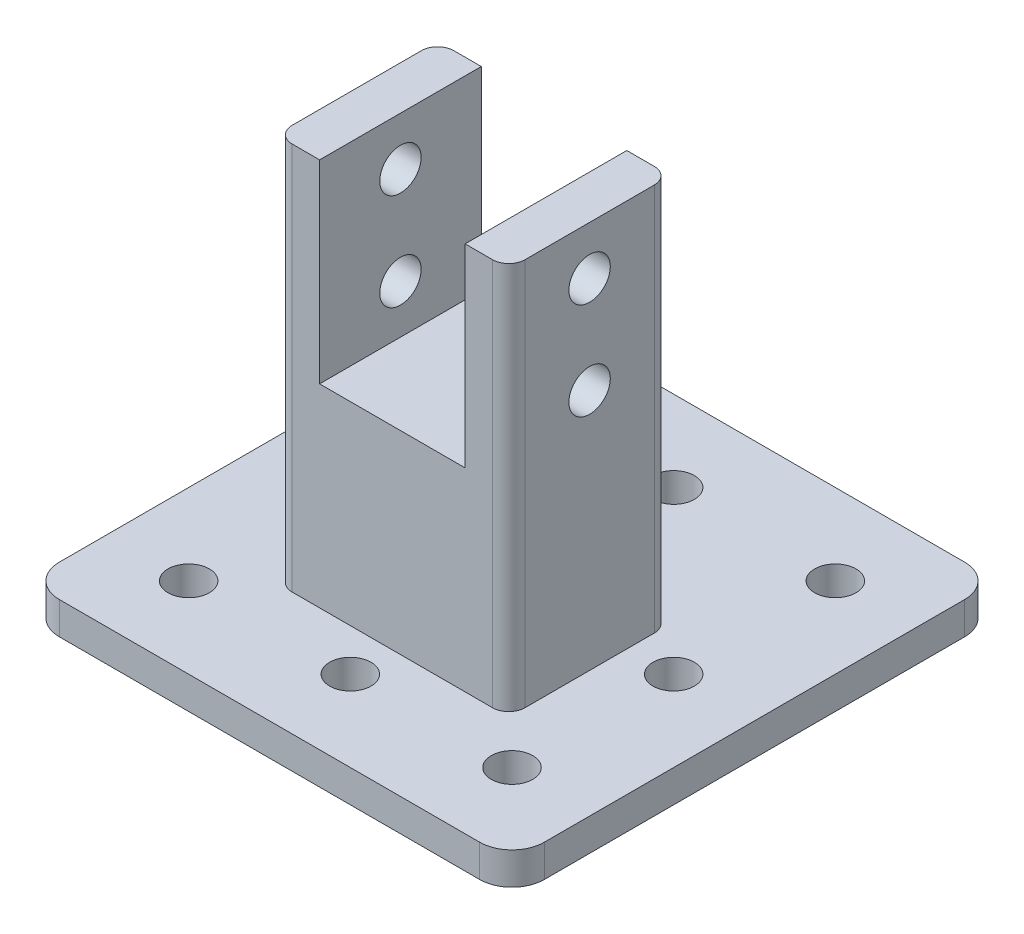
ISO-10303-21;
HEADER;
FILE_DESCRIPTION(('STEP AP214'),'2;1');
FILE_NAME('part.step','',(''),(''),'','','');
FILE_SCHEMA(('AUTOMOTIVE_DESIGN { 1 0 10303 214 1 1 1 1 }'));
ENDSEC;
DATA;
#1=APPLICATION_CONTEXT('core data for automotive mechanical design processes');
#2=APPLICATION_PROTOCOL_DEFINITION('international standard','automotive_design',2000,#1);
#3=PRODUCT_CONTEXT('',#1,'mechanical');
#4=PRODUCT('Part','Part','',(#3));
#5=PRODUCT_RELATED_PRODUCT_CATEGORY('part','',(#4));
#6=PRODUCT_DEFINITION_FORMATION('','',#4);
#7=PRODUCT_DEFINITION_CONTEXT('part definition',#1,'design');
#8=PRODUCT_DEFINITION('design','',#6,#7);
#9=PRODUCT_DEFINITION_SHAPE('','',#8);
#10=(LENGTH_UNIT() NAMED_UNIT(*) SI_UNIT(.MILLI.,.METRE.));
#11=(NAMED_UNIT(*) PLANE_ANGLE_UNIT() SI_UNIT($,.RADIAN.));
#12=(NAMED_UNIT(*) SI_UNIT($,.STERADIAN.) SOLID_ANGLE_UNIT());
#13=UNCERTAINTY_MEASURE_WITH_UNIT(LENGTH_MEASURE(1.E-05),#10,'distance_accuracy_value','');
#14=(GEOMETRIC_REPRESENTATION_CONTEXT(3) GLOBAL_UNCERTAINTY_ASSIGNED_CONTEXT((#13)) GLOBAL_UNIT_ASSIGNED_CONTEXT((#10,
#11,#12)) REPRESENTATION_CONTEXT('',''));
#15=CARTESIAN_POINT('',(0.,0.,0.));
#16=DIRECTION('',(0.,0.,1.));
#17=DIRECTION('',(1.,0.,0.));
#18=AXIS2_PLACEMENT_3D('',#15,#16,#17);
#19=CARTESIAN_POINT('',(0.,35.,0.));
#20=DIRECTION('',(0.,-1.,0.));
#21=DIRECTION('',(0.,0.,-1.));
#22=AXIS2_PLACEMENT_3D('',#19,#20,#21);
#23=PLANE('',#22);
#24=DIRECTION('',(0.,0.,-1.));
#25=VECTOR('',#24,1.);
#26=CARTESIAN_POINT('',(11.25,35.,-6.5));
#27=LINE('',#26,#25);
#28=CARTESIAN_POINT('',(11.25,35.,18.5));
#29=VERTEX_POINT('',#28);
#30=CARTESIAN_POINT('',(11.25,35.,-6.5));
#31=VERTEX_POINT('',#30);
#32=EDGE_CURVE('E50',#29,#31,#27,.T.);
#33=ORIENTED_EDGE('',*,*,#32,.T.);
#34=DIRECTION('',(1.,0.,0.));
#35=VECTOR('',#34,1.);
#36=CARTESIAN_POINT('',(18.,35.,-6.5));
#37=LINE('',#36,#35);
#38=CARTESIAN_POINT('',(-11.25,35.,-6.5));
#39=VERTEX_POINT('',#38);
#40=EDGE_CURVE('E245',#39,#31,#37,.T.);
#41=ORIENTED_EDGE('',*,*,#40,.F.);
#42=DIRECTION('',(0.,0.,1.));
#43=VECTOR('',#42,1.);
#44=CARTESIAN_POINT('',(-11.25,35.,-6.5));
#45=LINE('',#44,#43);
#46=CARTESIAN_POINT('',(-11.25,35.,18.5));
#47=VERTEX_POINT('',#46);
#48=EDGE_CURVE('E214',#39,#47,#45,.T.);
#49=ORIENTED_EDGE('',*,*,#48,.T.);
#50=DIRECTION('',(-1.,0.,0.));
#51=VECTOR('',#50,1.);
#52=CARTESIAN_POINT('',(18.,35.,18.5));
#53=LINE('',#52,#51);
#54=EDGE_CURVE('E55',#29,#47,#53,.T.);
#55=ORIENTED_EDGE('',*,*,#54,.F.);
#56=EDGE_LOOP('',(#33,#41,#49,#55));
#57=FACE_BOUND('',#56,.T.);
#58=ADVANCED_FACE('F33',(#57),#23,.F.);
#59=CARTESIAN_POINT('',(-32.5,5.,32.5));
#60=DIRECTION('',(0.,1.,0.));
#61=DIRECTION('',(0.,0.,1.));
#62=AXIS2_PLACEMENT_3D('',#59,#60,#61);
#63=PLANE('',#62);
#64=CARTESIAN_POINT('',(-25.,5.,-25.));
#65=DIRECTION('',(0.,1.,0.));
#66=DIRECTION('',(0.,0.,1.));
#67=AXIS2_PLACEMENT_3D('',#64,#65,#66);
#68=CIRCLE('',#67,3.2);
#69=CARTESIAN_POINT('',(-25.,5.,-21.8));
#70=VERTEX_POINT('',#69);
#71=EDGE_CURVE('E249',#70,#70,#68,.T.);
#72=ORIENTED_EDGE('',*,*,#71,.F.);
#73=EDGE_LOOP('',(#72));
#74=FACE_BOUND('',#73,.T.);
#75=CARTESIAN_POINT('',(-25.,5.,0.));
#76=DIRECTION('',(0.,1.,0.));
#77=DIRECTION('',(0.,0.,1.));
#78=AXIS2_PLACEMENT_3D('',#75,#76,#77);
#79=CIRCLE('',#78,3.2);
#80=CARTESIAN_POINT('',(-25.,5.,3.2));
#81=VERTEX_POINT('',#80);
#82=EDGE_CURVE('E257',#81,#81,#79,.T.);
#83=ORIENTED_EDGE('',*,*,#82,.F.);
#84=EDGE_LOOP('',(#83));
#85=FACE_BOUND('',#84,.T.);
#86=CARTESIAN_POINT('',(-25.,5.,25.));
#87=DIRECTION('',(0.,1.,0.));
#88=DIRECTION('',(0.,0.,1.));
#89=AXIS2_PLACEMENT_3D('',#86,#87,#88);
#90=CIRCLE('',#89,3.2);
#91=CARTESIAN_POINT('',(-25.,5.,28.2));
#92=VERTEX_POINT('',#91);
#93=EDGE_CURVE('E263',#92,#92,#90,.T.);
#94=ORIENTED_EDGE('',*,*,#93,.F.);
#95=EDGE_LOOP('',(#94));
#96=FACE_BOUND('',#95,.T.);
#97=CARTESIAN_POINT('',(0.,5.,25.));
#98=DIRECTION('',(0.,1.,0.));
#99=DIRECTION('',(0.,0.,1.));
#100=AXIS2_PLACEMENT_3D('',#97,#98,#99);
#101=CIRCLE('',#100,3.2);
#102=CARTESIAN_POINT('',(0.,5.,28.2));
#103=VERTEX_POINT('',#102);
#104=EDGE_CURVE('E269',#103,#103,#101,.T.);
#105=ORIENTED_EDGE('',*,*,#104,.F.);
#106=EDGE_LOOP('',(#105));
#107=FACE_BOUND('',#106,.T.);
#108=CARTESIAN_POINT('',(25.,5.,25.));
#109=DIRECTION('',(0.,1.,0.));
#110=DIRECTION('',(0.,0.,1.));
#111=AXIS2_PLACEMENT_3D('',#108,#109,#110);
#112=CIRCLE('',#111,3.2);
#113=CARTESIAN_POINT('',(25.,5.,28.2));
#114=VERTEX_POINT('',#113);
#115=EDGE_CURVE('E275',#114,#114,#112,.T.);
#116=ORIENTED_EDGE('',*,*,#115,.F.);
#117=EDGE_LOOP('',(#116));
#118=FACE_BOUND('',#117,.T.);
#119=CARTESIAN_POINT('',(25.,5.,0.));
#120=DIRECTION('',(0.,1.,0.));
#121=DIRECTION('',(0.,0.,1.));
#122=AXIS2_PLACEMENT_3D('',#119,#120,#121);
#123=CIRCLE('',#122,3.2);
#124=CARTESIAN_POINT('',(25.,5.,3.2));
#125=VERTEX_POINT('',#124);
#126=EDGE_CURVE('E281',#125,#125,#123,.T.);
#127=ORIENTED_EDGE('',*,*,#126,.F.);
#128=EDGE_LOOP('',(#127));
#129=FACE_BOUND('',#128,.T.);
#130=CARTESIAN_POINT('',(25.,5.,-25.));
#131=DIRECTION('',(0.,1.,0.));
#132=DIRECTION('',(0.,0.,1.));
#133=AXIS2_PLACEMENT_3D('',#130,#131,#132);
#134=CIRCLE('',#133,3.2);
#135=CARTESIAN_POINT('',(25.,5.,-21.8));
#136=VERTEX_POINT('',#135);
#137=EDGE_CURVE('E243',#136,#136,#134,.T.);
#138=ORIENTED_EDGE('',*,*,#137,.F.);
#139=EDGE_LOOP('',(#138));
#140=FACE_BOUND('',#139,.T.);
#141=CARTESIAN_POINT('',(0.,5.,-25.));
#142=DIRECTION('',(0.,1.,0.));
#143=DIRECTION('',(0.,0.,1.));
#144=AXIS2_PLACEMENT_3D('',#141,#142,#143);
#145=CIRCLE('',#144,3.2);
#146=CARTESIAN_POINT('',(0.,5.,-21.8));
#147=VERTEX_POINT('',#146);
#148=EDGE_CURVE('E256',#147,#147,#145,.T.);
#149=ORIENTED_EDGE('',*,*,#148,.F.);
#150=EDGE_LOOP('',(#149));
#151=FACE_BOUND('',#150,.T.);
#152=CARTESIAN_POINT('',(-32.5,5.,32.5));
#153=DIRECTION('',(0.,1.,0.));
#154=DIRECTION('',(0.,0.,1.));
#155=AXIS2_PLACEMENT_3D('',#152,#153,#154);
#156=CIRCLE('',#155,4.99999999999999);
#157=CARTESIAN_POINT('',(-37.5,5.,32.5));
#158=VERTEX_POINT('',#157);
#159=CARTESIAN_POINT('',(-32.5,5.,37.5));
#160=VERTEX_POINT('',#159);
#161=EDGE_CURVE('E297',#158,#160,#156,.T.);
#162=ORIENTED_EDGE('',*,*,#161,.T.);
#163=DIRECTION('',(1.,0.,0.));
#164=VECTOR('',#163,1.);
#165=CARTESIAN_POINT('',(-32.5,5.,37.5));
#166=LINE('',#165,#164);
#167=CARTESIAN_POINT('',(32.5,5.,37.5));
#168=VERTEX_POINT('',#167);
#169=EDGE_CURVE('E300',#160,#168,#166,.T.);
#170=ORIENTED_EDGE('',*,*,#169,.T.);
#171=CARTESIAN_POINT('',(32.5,5.,32.5));
#172=DIRECTION('',(0.,1.,0.));
#173=DIRECTION('',(0.,0.,1.));
#174=AXIS2_PLACEMENT_3D('',#171,#172,#173);
#175=CIRCLE('',#174,4.99999999999999);
#176=CARTESIAN_POINT('',(37.5,5.,32.5));
#177=VERTEX_POINT('',#176);
#178=EDGE_CURVE('E303',#168,#177,#175,.T.);
#179=ORIENTED_EDGE('',*,*,#178,.T.);
#180=DIRECTION('',(0.,0.,-1.));
#181=VECTOR('',#180,1.);
#182=CARTESIAN_POINT('',(37.5,5.,-32.5));
#183=LINE('',#182,#181);
#184=CARTESIAN_POINT('',(37.5,5.,-32.5));
#185=VERTEX_POINT('',#184);
#186=EDGE_CURVE('E305',#177,#185,#183,.T.);
#187=ORIENTED_EDGE('',*,*,#186,.T.);
#188=CARTESIAN_POINT('',(32.5,5.,-32.5));
#189=DIRECTION('',(0.,1.,0.));
#190=DIRECTION('',(0.,0.,-1.));
#191=AXIS2_PLACEMENT_3D('',#188,#189,#190);
#192=CIRCLE('',#191,4.99999999999999);
#193=CARTESIAN_POINT('',(32.5,5.,-37.5));
#194=VERTEX_POINT('',#193);
#195=EDGE_CURVE('E307',#185,#194,#192,.T.);
#196=ORIENTED_EDGE('',*,*,#195,.T.);
#197=DIRECTION('',(-1.,0.,0.));
#198=VECTOR('',#197,1.);
#199=CARTESIAN_POINT('',(-32.5,5.,-37.5));
#200=LINE('',#199,#198);
#201=CARTESIAN_POINT('',(-32.5,5.,-37.5));
#202=VERTEX_POINT('',#201);
#203=EDGE_CURVE('E309',#194,#202,#200,.T.);
#204=ORIENTED_EDGE('',*,*,#203,.T.);
#205=CARTESIAN_POINT('',(-32.5,5.,-32.5));
#206=DIRECTION('',(0.,1.,0.));
#207=DIRECTION('',(0.,0.,1.));
#208=AXIS2_PLACEMENT_3D('',#205,#206,#207);
#209=CIRCLE('',#208,4.99999999999999);
#210=CARTESIAN_POINT('',(-37.5,5.,-32.5));
#211=VERTEX_POINT('',#210);
#212=EDGE_CURVE('E311',#202,#211,#209,.T.);
#213=ORIENTED_EDGE('',*,*,#212,.T.);
#214=DIRECTION('',(0.,0.,1.));
#215=VECTOR('',#214,1.);
#216=CARTESIAN_POINT('',(-37.5,5.,-32.5));
#217=LINE('',#216,#215);
#218=EDGE_CURVE('E313',#211,#158,#217,.T.);
#219=ORIENTED_EDGE('',*,*,#218,.T.);
#220=EDGE_LOOP('',(#162,#170,#179,#187,#196,#204,#213,#219));
#221=FACE_BOUND('',#220,.T.);
#222=DIRECTION('',(0.,0.,1.));
#223=VECTOR('',#222,1.);
#224=CARTESIAN_POINT('',(-18.,5.,-6.5));
#225=LINE('',#224,#223);
#226=CARTESIAN_POINT('',(-18.,5.,-4.));
#227=VERTEX_POINT('',#226);
#228=CARTESIAN_POINT('',(-18.,5.,16.));
#229=VERTEX_POINT('',#228);
#230=EDGE_CURVE('E234',#227,#229,#225,.T.);
#231=ORIENTED_EDGE('',*,*,#230,.F.);
#232=CARTESIAN_POINT('',(-15.5,5.,-4.));
#233=DIRECTION('',(0.,1.,0.));
#234=DIRECTION('',(0.,0.,1.));
#235=AXIS2_PLACEMENT_3D('',#232,#233,#234);
#236=CIRCLE('',#235,2.5);
#237=CARTESIAN_POINT('',(-15.5,5.,-6.5));
#238=VERTEX_POINT('',#237);
#239=EDGE_CURVE('E368',#227,#238,#236,.F.);
#240=ORIENTED_EDGE('',*,*,#239,.T.);
#241=DIRECTION('',(-1.,0.,0.));
#242=VECTOR('',#241,1.);
#243=CARTESIAN_POINT('',(18.,5.,-6.5));
#244=LINE('',#243,#242);
#245=CARTESIAN_POINT('',(15.5,5.,-6.5));
#246=VERTEX_POINT('',#245);
#247=EDGE_CURVE('E238',#246,#238,#244,.T.);
#248=ORIENTED_EDGE('',*,*,#247,.F.);
#249=CARTESIAN_POINT('',(15.5,5.,-4.));
#250=DIRECTION('',(0.,1.,0.));
#251=DIRECTION('',(0.,0.,1.));
#252=AXIS2_PLACEMENT_3D('',#249,#250,#251);
#253=CIRCLE('',#252,2.5);
#254=CARTESIAN_POINT('',(18.,5.,-4.));
#255=VERTEX_POINT('',#254);
#256=EDGE_CURVE('E42',#246,#255,#253,.F.);
#257=ORIENTED_EDGE('',*,*,#256,.T.);
#258=DIRECTION('',(0.,0.,-1.));
#259=VECTOR('',#258,1.);
#260=CARTESIAN_POINT('',(18.,5.,-6.5));
#261=LINE('',#260,#259);
#262=CARTESIAN_POINT('',(18.,5.,16.));
#263=VERTEX_POINT('',#262);
#264=EDGE_CURVE('E241',#263,#255,#261,.T.);
#265=ORIENTED_EDGE('',*,*,#264,.F.);
#266=CARTESIAN_POINT('',(15.5,5.,16.));
#267=DIRECTION('',(0.,1.,0.));
#268=DIRECTION('',(0.,0.,1.));
#269=AXIS2_PLACEMENT_3D('',#266,#267,#268);
#270=CIRCLE('',#269,2.5);
#271=CARTESIAN_POINT('',(15.5,5.,18.5));
#272=VERTEX_POINT('',#271);
#273=EDGE_CURVE('E11',#263,#272,#270,.F.);
#274=ORIENTED_EDGE('',*,*,#273,.T.);
#275=DIRECTION('',(1.,0.,0.));
#276=VECTOR('',#275,1.);
#277=CARTESIAN_POINT('',(18.,5.,18.5));
#278=LINE('',#277,#276);
#279=CARTESIAN_POINT('',(-15.5,5.,18.5));
#280=VERTEX_POINT('',#279);
#281=EDGE_CURVE('E237',#280,#272,#278,.T.);
#282=ORIENTED_EDGE('',*,*,#281,.F.);
#283=CARTESIAN_POINT('',(-15.5,5.,16.));
#284=DIRECTION('',(0.,1.,0.));
#285=DIRECTION('',(0.,0.,1.));
#286=AXIS2_PLACEMENT_3D('',#283,#284,#285);
#287=CIRCLE('',#286,2.5);
#288=EDGE_CURVE('E366',#280,#229,#287,.F.);
#289=ORIENTED_EDGE('',*,*,#288,.T.);
#290=EDGE_LOOP('',(#231,#240,#248,#257,#265,#274,#282,#289));
#291=FACE_BOUND('',#290,.T.);
#292=ADVANCED_FACE('F408',(#74,#85,#96,#107,#118,#129,#140,#151,#221,#291),#63,.T.);
#293=CARTESIAN_POINT('',(-32.5,5.,32.5));
#294=DIRECTION('',(0.,-1.,0.));
#295=DIRECTION('',(0.,0.,-1.));
#296=AXIS2_PLACEMENT_3D('',#293,#294,#295);
#297=CYLINDRICAL_SURFACE('',#296,4.99999999999999);
#298=CARTESIAN_POINT('',(-32.5,0.,32.5));
#299=DIRECTION('',(0.,1.,0.));
#300=DIRECTION('',(0.,0.,1.));
#301=AXIS2_PLACEMENT_3D('',#298,#299,#300);
#302=CIRCLE('',#301,4.99999999999999);
#303=CARTESIAN_POINT('',(-37.5,0.,32.5));
#304=VERTEX_POINT('',#303);
#305=CARTESIAN_POINT('',(-32.5,0.,37.5));
#306=VERTEX_POINT('',#305);
#307=EDGE_CURVE('E296',#304,#306,#302,.T.);
#308=ORIENTED_EDGE('',*,*,#307,.T.);
#309=DIRECTION('',(0.,-1.,0.));
#310=VECTOR('',#309,1.);
#311=CARTESIAN_POINT('',(-32.5,5.,37.5));
#312=LINE('',#311,#310);
#313=EDGE_CURVE('E351',#160,#306,#312,.T.);
#314=ORIENTED_EDGE('',*,*,#313,.F.);
#315=ORIENTED_EDGE('',*,*,#161,.F.);
#316=DIRECTION('',(0.,-1.,0.));
#317=VECTOR('',#316,1.);
#318=CARTESIAN_POINT('',(-37.5,5.,32.5));
#319=LINE('',#318,#317);
#320=EDGE_CURVE('E315',#158,#304,#319,.T.);
#321=ORIENTED_EDGE('',*,*,#320,.T.);
#322=EDGE_LOOP('',(#308,#314,#315,#321));
#323=FACE_BOUND('',#322,.T.);
#324=ADVANCED_FACE('F438',(#323),#297,.T.);
#325=CARTESIAN_POINT('',(-32.5,5.,37.5));
#326=DIRECTION('',(0.,0.,-1.));
#327=DIRECTION('',(-1.,0.,0.));
#328=AXIS2_PLACEMENT_3D('',#325,#326,#327);
#329=PLANE('',#328);
#330=DIRECTION('',(1.,0.,0.));
#331=VECTOR('',#330,1.);
#332=CARTESIAN_POINT('',(-32.5,0.,37.5));
#333=LINE('',#332,#331);
#334=CARTESIAN_POINT('',(32.5,0.,37.5));
#335=VERTEX_POINT('',#334);
#336=EDGE_CURVE('E318',#306,#335,#333,.T.);
#337=ORIENTED_EDGE('',*,*,#336,.T.);
#338=DIRECTION('',(0.,-1.,0.));
#339=VECTOR('',#338,1.);
#340=CARTESIAN_POINT('',(32.5,5.,37.5));
#341=LINE('',#340,#339);
#342=EDGE_CURVE('E348',#168,#335,#341,.T.);
#343=ORIENTED_EDGE('',*,*,#342,.F.);
#344=ORIENTED_EDGE('',*,*,#169,.F.);
#345=ORIENTED_EDGE('',*,*,#313,.T.);
#346=EDGE_LOOP('',(#337,#343,#344,#345));
#347=FACE_BOUND('',#346,.T.);
#348=ADVANCED_FACE('F511',(#347),#329,.F.);
#349=CARTESIAN_POINT('',(32.5,5.,32.5));
#350=DIRECTION('',(0.,-1.,0.));
#351=DIRECTION('',(0.,0.,-1.));
#352=AXIS2_PLACEMENT_3D('',#349,#350,#351);
#353=CYLINDRICAL_SURFACE('',#352,4.99999999999999);
#354=CARTESIAN_POINT('',(32.5,0.,32.5));
#355=DIRECTION('',(0.,1.,0.));
#356=DIRECTION('',(0.,0.,1.));
#357=AXIS2_PLACEMENT_3D('',#354,#355,#356);
#358=CIRCLE('',#357,4.99999999999999);
#359=CARTESIAN_POINT('',(37.5,0.,32.5));
#360=VERTEX_POINT('',#359);
#361=EDGE_CURVE('E320',#335,#360,#358,.T.);
#362=ORIENTED_EDGE('',*,*,#361,.T.);
#363=DIRECTION('',(0.,-1.,0.));
#364=VECTOR('',#363,1.);
#365=CARTESIAN_POINT('',(37.5,5.,32.5));
#366=LINE('',#365,#364);
#367=EDGE_CURVE('E345',#177,#360,#366,.T.);
#368=ORIENTED_EDGE('',*,*,#367,.F.);
#369=ORIENTED_EDGE('',*,*,#178,.F.);
#370=ORIENTED_EDGE('',*,*,#342,.T.);
#371=EDGE_LOOP('',(#362,#368,#369,#370));
#372=FACE_BOUND('',#371,.T.);
#373=ADVANCED_FACE('F507',(#372),#353,.T.);
#374=CARTESIAN_POINT('',(37.5,5.,-32.5));
#375=DIRECTION('',(-1.,0.,0.));
#376=DIRECTION('',(0.,0.,1.));
#377=AXIS2_PLACEMENT_3D('',#374,#375,#376);
#378=PLANE('',#377);
#379=DIRECTION('',(0.,0.,-1.));
#380=VECTOR('',#379,1.);
#381=CARTESIAN_POINT('',(37.5,0.,-32.5));
#382=LINE('',#381,#380);
#383=CARTESIAN_POINT('',(37.5,0.,-32.5));
#384=VERTEX_POINT('',#383);
#385=EDGE_CURVE('E322',#360,#384,#382,.T.);
#386=ORIENTED_EDGE('',*,*,#385,.T.);
#387=DIRECTION('',(0.,-1.,0.));
#388=VECTOR('',#387,1.);
#389=CARTESIAN_POINT('',(37.5,5.,-32.5));
#390=LINE('',#389,#388);
#391=EDGE_CURVE('E342',#185,#384,#390,.T.);
#392=ORIENTED_EDGE('',*,*,#391,.F.);
#393=ORIENTED_EDGE('',*,*,#186,.F.);
#394=ORIENTED_EDGE('',*,*,#367,.T.);
#395=EDGE_LOOP('',(#386,#392,#393,#394));
#396=FACE_BOUND('',#395,.T.);
#397=ADVANCED_FACE('F503',(#396),#378,.F.);
#398=CARTESIAN_POINT('',(32.5,5.,-32.5));
#399=DIRECTION('',(0.,-1.,0.));
#400=DIRECTION('',(0.,0.,-1.));
#401=AXIS2_PLACEMENT_3D('',#398,#399,#400);
#402=CYLINDRICAL_SURFACE('',#401,4.99999999999999);
#403=CARTESIAN_POINT('',(32.5,0.,-32.5));
#404=DIRECTION('',(0.,1.,0.));
#405=DIRECTION('',(0.,0.,-1.));
#406=AXIS2_PLACEMENT_3D('',#403,#404,#405);
#407=CIRCLE('',#406,4.99999999999999);
#408=CARTESIAN_POINT('',(32.5,0.,-37.5));
#409=VERTEX_POINT('',#408);
#410=EDGE_CURVE('E324',#384,#409,#407,.T.);
#411=ORIENTED_EDGE('',*,*,#410,.T.);
#412=DIRECTION('',(0.,-1.,0.));
#413=VECTOR('',#412,1.);
#414=CARTESIAN_POINT('',(32.5,5.,-37.5));
#415=LINE('',#414,#413);
#416=EDGE_CURVE('E339',#194,#409,#415,.T.);
#417=ORIENTED_EDGE('',*,*,#416,.F.);
#418=ORIENTED_EDGE('',*,*,#195,.F.);
#419=ORIENTED_EDGE('',*,*,#391,.T.);
#420=EDGE_LOOP('',(#411,#417,#418,#419));
#421=FACE_BOUND('',#420,.T.);
#422=ADVANCED_FACE('F499',(#421),#402,.T.);
#423=CARTESIAN_POINT('',(-32.5,5.,-37.5));
#424=DIRECTION('',(0.,0.,1.));
#425=DIRECTION('',(1.,0.,0.));
#426=AXIS2_PLACEMENT_3D('',#423,#424,#425);
#427=PLANE('',#426);
#428=DIRECTION('',(-1.,0.,0.));
#429=VECTOR('',#428,1.);
#430=CARTESIAN_POINT('',(-32.5,0.,-37.5));
#431=LINE('',#430,#429);
#432=CARTESIAN_POINT('',(-32.5,0.,-37.5));
#433=VERTEX_POINT('',#432);
#434=EDGE_CURVE('E326',#409,#433,#431,.T.);
#435=ORIENTED_EDGE('',*,*,#434,.T.);
#436=DIRECTION('',(0.,-1.,0.));
#437=VECTOR('',#436,1.);
#438=CARTESIAN_POINT('',(-32.5,5.,-37.5));
#439=LINE('',#438,#437);
#440=EDGE_CURVE('E336',#202,#433,#439,.T.);
#441=ORIENTED_EDGE('',*,*,#440,.F.);
#442=ORIENTED_EDGE('',*,*,#203,.F.);
#443=ORIENTED_EDGE('',*,*,#416,.T.);
#444=EDGE_LOOP('',(#435,#441,#442,#443));
#445=FACE_BOUND('',#444,.T.);
#446=ADVANCED_FACE('F495',(#445),#427,.F.);
#447=CARTESIAN_POINT('',(-32.5,5.,-32.5));
#448=DIRECTION('',(0.,-1.,0.));
#449=DIRECTION('',(0.,0.,-1.));
#450=AXIS2_PLACEMENT_3D('',#447,#448,#449);
#451=CYLINDRICAL_SURFACE('',#450,4.99999999999999);
#452=CARTESIAN_POINT('',(-32.5,0.,-32.5));
#453=DIRECTION('',(0.,1.,0.));
#454=DIRECTION('',(0.,0.,1.));
#455=AXIS2_PLACEMENT_3D('',#452,#453,#454);
#456=CIRCLE('',#455,4.99999999999999);
#457=CARTESIAN_POINT('',(-37.5,0.,-32.5));
#458=VERTEX_POINT('',#457);
#459=EDGE_CURVE('E328',#433,#458,#456,.T.);
#460=ORIENTED_EDGE('',*,*,#459,.T.);
#461=DIRECTION('',(0.,-1.,0.));
#462=VECTOR('',#461,1.);
#463=CARTESIAN_POINT('',(-37.5,5.,-32.5));
#464=LINE('',#463,#462);
#465=EDGE_CURVE('E333',#211,#458,#464,.T.);
#466=ORIENTED_EDGE('',*,*,#465,.F.);
#467=ORIENTED_EDGE('',*,*,#212,.F.);
#468=ORIENTED_EDGE('',*,*,#440,.T.);
#469=EDGE_LOOP('',(#460,#466,#467,#468));
#470=FACE_BOUND('',#469,.T.);
#471=ADVANCED_FACE('F491',(#470),#451,.T.);
#472=CARTESIAN_POINT('',(-37.5,5.,-32.5));
#473=DIRECTION('',(1.,0.,0.));
#474=DIRECTION('',(0.,0.,-1.));
#475=AXIS2_PLACEMENT_3D('',#472,#473,#474);
#476=PLANE('',#475);
#477=DIRECTION('',(0.,0.,1.));
#478=VECTOR('',#477,1.);
#479=CARTESIAN_POINT('',(-37.5,0.,-32.5));
#480=LINE('',#479,#478);
#481=EDGE_CURVE('E301',#458,#304,#480,.T.);
#482=ORIENTED_EDGE('',*,*,#481,.T.);
#483=ORIENTED_EDGE('',*,*,#320,.F.);
#484=ORIENTED_EDGE('',*,*,#218,.F.);
#485=ORIENTED_EDGE('',*,*,#465,.T.);
#486=EDGE_LOOP('',(#482,#483,#484,#485));
#487=FACE_BOUND('',#486,.T.);
#488=ADVANCED_FACE('F487',(#487),#476,.F.);
#489=CARTESIAN_POINT('',(-32.5,0.,32.5));
#490=DIRECTION('',(0.,1.,0.));
#491=DIRECTION('',(0.,0.,1.));
#492=AXIS2_PLACEMENT_3D('',#489,#490,#491);
#493=PLANE('',#492);
#494=CARTESIAN_POINT('',(-25.,0.,-25.));
#495=DIRECTION('',(0.,1.,0.));
#496=DIRECTION('',(0.,0.,1.));
#497=AXIS2_PLACEMENT_3D('',#494,#495,#496);
#498=CIRCLE('',#497,3.2);
#499=CARTESIAN_POINT('',(-25.,0.,-21.8));
#500=VERTEX_POINT('',#499);
#501=EDGE_CURVE('E252',#500,#500,#498,.F.);
#502=ORIENTED_EDGE('',*,*,#501,.F.);
#503=EDGE_LOOP('',(#502));
#504=FACE_BOUND('',#503,.T.);
#505=CARTESIAN_POINT('',(-25.,0.,0.));
#506=DIRECTION('',(0.,1.,0.));
#507=DIRECTION('',(0.,0.,1.));
#508=AXIS2_PLACEMENT_3D('',#505,#506,#507);
#509=CIRCLE('',#508,3.2);
#510=CARTESIAN_POINT('',(-25.,0.,3.2));
#511=VERTEX_POINT('',#510);
#512=EDGE_CURVE('E253',#511,#511,#509,.F.);
#513=ORIENTED_EDGE('',*,*,#512,.F.);
#514=EDGE_LOOP('',(#513));
#515=FACE_BOUND('',#514,.T.);
#516=CARTESIAN_POINT('',(-25.,0.,25.));
#517=DIRECTION('',(0.,1.,0.));
#518=DIRECTION('',(0.,0.,1.));
#519=AXIS2_PLACEMENT_3D('',#516,#517,#518);
#520=CIRCLE('',#519,3.2);
#521=CARTESIAN_POINT('',(-25.,0.,28.2));
#522=VERTEX_POINT('',#521);
#523=EDGE_CURVE('E260',#522,#522,#520,.F.);
#524=ORIENTED_EDGE('',*,*,#523,.F.);
#525=EDGE_LOOP('',(#524));
#526=FACE_BOUND('',#525,.T.);
#527=CARTESIAN_POINT('',(0.,0.,25.));
#528=DIRECTION('',(0.,1.,0.));
#529=DIRECTION('',(0.,0.,1.));
#530=AXIS2_PLACEMENT_3D('',#527,#528,#529);
#531=CIRCLE('',#530,3.2);
#532=CARTESIAN_POINT('',(0.,0.,28.2));
#533=VERTEX_POINT('',#532);
#534=EDGE_CURVE('E266',#533,#533,#531,.F.);
#535=ORIENTED_EDGE('',*,*,#534,.F.);
#536=EDGE_LOOP('',(#535));
#537=FACE_BOUND('',#536,.T.);
#538=CARTESIAN_POINT('',(25.,0.,25.));
#539=DIRECTION('',(0.,1.,0.));
#540=DIRECTION('',(0.,0.,1.));
#541=AXIS2_PLACEMENT_3D('',#538,#539,#540);
#542=CIRCLE('',#541,3.2);
#543=CARTESIAN_POINT('',(25.,0.,28.2));
#544=VERTEX_POINT('',#543);
#545=EDGE_CURVE('E272',#544,#544,#542,.F.);
#546=ORIENTED_EDGE('',*,*,#545,.F.);
#547=EDGE_LOOP('',(#546));
#548=FACE_BOUND('',#547,.T.);
#549=CARTESIAN_POINT('',(25.,0.,0.));
#550=DIRECTION('',(0.,1.,0.));
#551=DIRECTION('',(0.,0.,1.));
#552=AXIS2_PLACEMENT_3D('',#549,#550,#551);
#553=CIRCLE('',#552,3.2);
#554=CARTESIAN_POINT('',(25.,0.,3.2));
#555=VERTEX_POINT('',#554);
#556=EDGE_CURVE('E278',#555,#555,#553,.F.);
#557=ORIENTED_EDGE('',*,*,#556,.F.);
#558=EDGE_LOOP('',(#557));
#559=FACE_BOUND('',#558,.T.);
#560=CARTESIAN_POINT('',(25.,0.,-25.));
#561=DIRECTION('',(0.,1.,0.));
#562=DIRECTION('',(0.,0.,1.));
#563=AXIS2_PLACEMENT_3D('',#560,#561,#562);
#564=CIRCLE('',#563,3.2);
#565=CARTESIAN_POINT('',(25.,0.,-21.8));
#566=VERTEX_POINT('',#565);
#567=EDGE_CURVE('E284',#566,#566,#564,.F.);
#568=ORIENTED_EDGE('',*,*,#567,.F.);
#569=EDGE_LOOP('',(#568));
#570=FACE_BOUND('',#569,.T.);
#571=CARTESIAN_POINT('',(0.,0.,-25.));
#572=DIRECTION('',(0.,1.,0.));
#573=DIRECTION('',(0.,0.,1.));
#574=AXIS2_PLACEMENT_3D('',#571,#572,#573);
#575=CIRCLE('',#574,3.2);
#576=CARTESIAN_POINT('',(0.,0.,-21.8));
#577=VERTEX_POINT('',#576);
#578=EDGE_CURVE('E293',#577,#577,#575,.F.);
#579=ORIENTED_EDGE('',*,*,#578,.F.);
#580=EDGE_LOOP('',(#579));
#581=FACE_BOUND('',#580,.T.);
#582=ORIENTED_EDGE('',*,*,#307,.F.);
#583=ORIENTED_EDGE('',*,*,#481,.F.);
#584=ORIENTED_EDGE('',*,*,#459,.F.);
#585=ORIENTED_EDGE('',*,*,#434,.F.);
#586=ORIENTED_EDGE('',*,*,#410,.F.);
#587=ORIENTED_EDGE('',*,*,#385,.F.);
#588=ORIENTED_EDGE('',*,*,#361,.F.);
#589=ORIENTED_EDGE('',*,*,#336,.F.);
#590=EDGE_LOOP('',(#582,#583,#584,#585,#586,#587,#588,#589));
#591=FACE_BOUND('',#590,.T.);
#592=ADVANCED_FACE('F482',(#504,#515,#526,#537,#548,#559,#570,#581,#591),#493,.F.);
#593=CARTESIAN_POINT('',(0.,-9.05096679918782,-25.));
#594=DIRECTION('',(0.,1.,0.));
#595=DIRECTION('',(0.,0.,1.));
#596=AXIS2_PLACEMENT_3D('',#593,#594,#595);
#597=CYLINDRICAL_SURFACE('',#596,3.2);
#598=ORIENTED_EDGE('',*,*,#578,.T.);
#599=EDGE_LOOP('',(#598));
#600=FACE_BOUND('',#599,.T.);
#601=ORIENTED_EDGE('',*,*,#148,.T.);
#602=EDGE_LOOP('',(#601));
#603=FACE_BOUND('',#602,.T.);
#604=ADVANCED_FACE('F479',(#600,#603),#597,.F.);
#605=CARTESIAN_POINT('',(25.,-9.05096679918782,-25.));
#606=DIRECTION('',(0.,1.,0.));
#607=DIRECTION('',(0.,0.,1.));
#608=AXIS2_PLACEMENT_3D('',#605,#606,#607);
#609=CYLINDRICAL_SURFACE('',#608,3.2);
#610=ORIENTED_EDGE('',*,*,#567,.T.);
#611=EDGE_LOOP('',(#610));
#612=FACE_BOUND('',#611,.T.);
#613=ORIENTED_EDGE('',*,*,#137,.T.);
#614=EDGE_LOOP('',(#613));
#615=FACE_BOUND('',#614,.T.);
#616=ADVANCED_FACE('F475',(#612,#615),#609,.F.);
#617=CARTESIAN_POINT('',(25.,-9.05096679918782,0.));
#618=DIRECTION('',(0.,1.,0.));
#619=DIRECTION('',(0.,0.,1.));
#620=AXIS2_PLACEMENT_3D('',#617,#618,#619);
#621=CYLINDRICAL_SURFACE('',#620,3.2);
#622=ORIENTED_EDGE('',*,*,#556,.T.);
#623=EDGE_LOOP('',(#622));
#624=FACE_BOUND('',#623,.T.);
#625=ORIENTED_EDGE('',*,*,#126,.T.);
#626=EDGE_LOOP('',(#625));
#627=FACE_BOUND('',#626,.T.);
#628=ADVANCED_FACE('F471',(#624,#627),#621,.F.);
#629=CARTESIAN_POINT('',(25.,-9.05096679918782,25.));
#630=DIRECTION('',(0.,1.,0.));
#631=DIRECTION('',(0.,0.,1.));
#632=AXIS2_PLACEMENT_3D('',#629,#630,#631);
#633=CYLINDRICAL_SURFACE('',#632,3.2);
#634=ORIENTED_EDGE('',*,*,#545,.T.);
#635=EDGE_LOOP('',(#634));
#636=FACE_BOUND('',#635,.T.);
#637=ORIENTED_EDGE('',*,*,#115,.T.);
#638=EDGE_LOOP('',(#637));
#639=FACE_BOUND('',#638,.T.);
#640=ADVANCED_FACE('F467',(#636,#639),#633,.F.);
#641=CARTESIAN_POINT('',(0.,-9.05096679918782,25.));
#642=DIRECTION('',(0.,1.,0.));
#643=DIRECTION('',(0.,0.,1.));
#644=AXIS2_PLACEMENT_3D('',#641,#642,#643);
#645=CYLINDRICAL_SURFACE('',#644,3.2);
#646=ORIENTED_EDGE('',*,*,#534,.T.);
#647=EDGE_LOOP('',(#646));
#648=FACE_BOUND('',#647,.T.);
#649=ORIENTED_EDGE('',*,*,#104,.T.);
#650=EDGE_LOOP('',(#649));
#651=FACE_BOUND('',#650,.T.);
#652=ADVANCED_FACE('F463',(#648,#651),#645,.F.);
#653=CARTESIAN_POINT('',(-25.,-9.05096679918782,25.));
#654=DIRECTION('',(0.,1.,0.));
#655=DIRECTION('',(0.,0.,1.));
#656=AXIS2_PLACEMENT_3D('',#653,#654,#655);
#657=CYLINDRICAL_SURFACE('',#656,3.2);
#658=ORIENTED_EDGE('',*,*,#523,.T.);
#659=EDGE_LOOP('',(#658));
#660=FACE_BOUND('',#659,.T.);
#661=ORIENTED_EDGE('',*,*,#93,.T.);
#662=EDGE_LOOP('',(#661));
#663=FACE_BOUND('',#662,.T.);
#664=ADVANCED_FACE('F459',(#660,#663),#657,.F.);
#665=CARTESIAN_POINT('',(-25.,-9.05096679918782,0.));
#666=DIRECTION('',(0.,1.,0.));
#667=DIRECTION('',(0.,0.,1.));
#668=AXIS2_PLACEMENT_3D('',#665,#666,#667);
#669=CYLINDRICAL_SURFACE('',#668,3.2);
#670=ORIENTED_EDGE('',*,*,#512,.T.);
#671=EDGE_LOOP('',(#670));
#672=FACE_BOUND('',#671,.T.);
#673=ORIENTED_EDGE('',*,*,#82,.T.);
#674=EDGE_LOOP('',(#673));
#675=FACE_BOUND('',#674,.T.);
#676=ADVANCED_FACE('F455',(#672,#675),#669,.F.);
#677=CARTESIAN_POINT('',(-25.,-9.05096679918782,-25.));
#678=DIRECTION('',(0.,1.,0.));
#679=DIRECTION('',(0.,0.,1.));
#680=AXIS2_PLACEMENT_3D('',#677,#678,#679);
#681=CYLINDRICAL_SURFACE('',#680,3.2);
#682=ORIENTED_EDGE('',*,*,#501,.T.);
#683=EDGE_LOOP('',(#682));
#684=FACE_BOUND('',#683,.T.);
#685=ORIENTED_EDGE('',*,*,#71,.T.);
#686=EDGE_LOOP('',(#685));
#687=FACE_BOUND('',#686,.T.);
#688=ADVANCED_FACE('F444',(#684,#687),#681,.F.);
#689=CARTESIAN_POINT('',(18.,-38.8292140016223,-6.5));
#690=DIRECTION('',(0.,0.,1.));
#691=DIRECTION('',(1.,0.,0.));
#692=AXIS2_PLACEMENT_3D('',#689,#690,#691);
#693=PLANE('',#692);
#694=ORIENTED_EDGE('',*,*,#247,.T.);
#695=DIRECTION('',(0.,1.,0.));
#696=VECTOR('',#695,1.);
#697=CARTESIAN_POINT('',(-15.5,-38.8292140016223,-6.5));
#698=LINE('',#697,#696);
#699=CARTESIAN_POINT('',(-15.5,65.,-6.5));
#700=VERTEX_POINT('',#699);
#701=EDGE_CURVE('E179',#238,#700,#698,.T.);
#702=ORIENTED_EDGE('',*,*,#701,.T.);
#703=DIRECTION('',(1.,0.,0.));
#704=VECTOR('',#703,1.);
#705=CARTESIAN_POINT('',(-11.25,65.,-6.5));
#706=LINE('',#705,#704);
#707=CARTESIAN_POINT('',(-11.25,65.,-6.5));
#708=VERTEX_POINT('',#707);
#709=EDGE_CURVE('E226',#700,#708,#706,.T.);
#710=ORIENTED_EDGE('',*,*,#709,.T.);
#711=DIRECTION('',(0.,1.,0.));
#712=VECTOR('',#711,1.);
#713=CARTESIAN_POINT('',(-11.25,9.10477843307767,-6.5));
#714=LINE('',#713,#712);
#715=EDGE_CURVE('E225',#39,#708,#714,.T.);
#716=ORIENTED_EDGE('',*,*,#715,.F.);
#717=ORIENTED_EDGE('',*,*,#40,.T.);
#718=DIRECTION('',(0.,1.,0.));
#719=VECTOR('',#718,1.);
#720=CARTESIAN_POINT('',(11.25,9.10477843307767,-6.5));
#721=LINE('',#720,#719);
#722=CARTESIAN_POINT('',(11.25,65.,-6.5));
#723=VERTEX_POINT('',#722);
#724=EDGE_CURVE('E208',#31,#723,#721,.T.);
#725=ORIENTED_EDGE('',*,*,#724,.T.);
#726=DIRECTION('',(1.,0.,0.));
#727=VECTOR('',#726,1.);
#728=CARTESIAN_POINT('',(15.5,65.,-6.5));
#729=LINE('',#728,#727);
#730=CARTESIAN_POINT('',(15.5,65.,-6.5));
#731=VERTEX_POINT('',#730);
#732=EDGE_CURVE('E210',#723,#731,#729,.T.);
#733=ORIENTED_EDGE('',*,*,#732,.T.);
#734=DIRECTION('',(0.,1.,0.));
#735=VECTOR('',#734,1.);
#736=CARTESIAN_POINT('',(15.5,-38.8292140016223,-6.5));
#737=LINE('',#736,#735);
#738=EDGE_CURVE('E362',#731,#246,#737,.F.);
#739=ORIENTED_EDGE('',*,*,#738,.T.);
#740=EDGE_LOOP('',(#694,#702,#710,#716,#717,#725,#733,#739));
#741=FACE_BOUND('',#740,.T.);
#742=ADVANCED_FACE('F393',(#741),#693,.F.);
#743=CARTESIAN_POINT('',(-18.,-38.8292140016223,-6.5));
#744=DIRECTION('',(1.,0.,0.));
#745=DIRECTION('',(0.,0.,-1.));
#746=AXIS2_PLACEMENT_3D('',#743,#744,#745);
#747=PLANE('',#746);
#748=CARTESIAN_POINT('',(-18.,42.5,6.));
#749=DIRECTION('',(1.,0.,0.));
#750=DIRECTION('',(0.,0.,-1.));
#751=AXIS2_PLACEMENT_3D('',#748,#749,#750);
#752=CIRCLE('',#751,3.2);
#753=CARTESIAN_POINT('',(-18.,42.5,2.8));
#754=VERTEX_POINT('',#753);
#755=EDGE_CURVE('E781',#754,#754,#752,.F.);
#756=ORIENTED_EDGE('',*,*,#755,.F.);
#757=EDGE_LOOP('',(#756));
#758=FACE_BOUND('',#757,.T.);
#759=CARTESIAN_POINT('',(-18.,57.5,6.));
#760=DIRECTION('',(1.,0.,0.));
#761=DIRECTION('',(0.,0.,-1.));
#762=AXIS2_PLACEMENT_3D('',#759,#760,#761);
#763=CIRCLE('',#762,3.2);
#764=CARTESIAN_POINT('',(-18.,57.5,2.8));
#765=VERTEX_POINT('',#764);
#766=EDGE_CURVE('E371',#765,#765,#763,.F.);
#767=ORIENTED_EDGE('',*,*,#766,.F.);
#768=EDGE_LOOP('',(#767));
#769=FACE_BOUND('',#768,.T.);
#770=ORIENTED_EDGE('',*,*,#230,.T.);
#771=DIRECTION('',(0.,1.,0.));
#772=VECTOR('',#771,1.);
#773=CARTESIAN_POINT('',(-18.,-38.8292140016223,16.));
#774=LINE('',#773,#772);
#775=CARTESIAN_POINT('',(-18.,65.,16.));
#776=VERTEX_POINT('',#775);
#777=EDGE_CURVE('E356',#229,#776,#774,.T.);
#778=ORIENTED_EDGE('',*,*,#777,.T.);
#779=DIRECTION('',(0.,0.,-1.));
#780=VECTOR('',#779,1.);
#781=CARTESIAN_POINT('',(-18.,65.,16.));
#782=LINE('',#781,#780);
#783=CARTESIAN_POINT('',(-18.,65.,-4.));
#784=VERTEX_POINT('',#783);
#785=EDGE_CURVE('E211',#776,#784,#782,.T.);
#786=ORIENTED_EDGE('',*,*,#785,.T.);
#787=DIRECTION('',(0.,1.,0.));
#788=VECTOR('',#787,1.);
#789=CARTESIAN_POINT('',(-18.,-38.8292140016223,-4.));
#790=LINE('',#789,#788);
#791=EDGE_CURVE('E354',#784,#227,#790,.F.);
#792=ORIENTED_EDGE('',*,*,#791,.T.);
#793=EDGE_LOOP('',(#770,#778,#786,#792));
#794=FACE_BOUND('',#793,.T.);
#795=ADVANCED_FACE('F414',(#758,#769,#794),#747,.F.);
#796=CARTESIAN_POINT('',(18.,-38.8292140016223,18.5));
#797=DIRECTION('',(0.,0.,-1.));
#798=DIRECTION('',(-1.,0.,0.));
#799=AXIS2_PLACEMENT_3D('',#796,#797,#798);
#800=PLANE('',#799);
#801=DIRECTION('',(0.,1.,0.));
#802=VECTOR('',#801,1.);
#803=CARTESIAN_POINT('',(15.5,-38.8292140016223,18.5));
#804=LINE('',#803,#802);
#805=CARTESIAN_POINT('',(15.5,65.,18.5));
#806=VERTEX_POINT('',#805);
#807=EDGE_CURVE('E358',#272,#806,#804,.T.);
#808=ORIENTED_EDGE('',*,*,#807,.T.);
#809=DIRECTION('',(-1.,0.,0.));
#810=VECTOR('',#809,1.);
#811=CARTESIAN_POINT('',(11.25,65.,18.5));
#812=LINE('',#811,#810);
#813=CARTESIAN_POINT('',(11.25,65.,18.5));
#814=VERTEX_POINT('',#813);
#815=EDGE_CURVE('E194',#806,#814,#812,.T.);
#816=ORIENTED_EDGE('',*,*,#815,.T.);
#817=DIRECTION('',(0.,1.,0.));
#818=VECTOR('',#817,1.);
#819=CARTESIAN_POINT('',(11.25,9.10477843307767,18.5));
#820=LINE('',#819,#818);
#821=EDGE_CURVE('E197',#29,#814,#820,.T.);
#822=ORIENTED_EDGE('',*,*,#821,.F.);
#823=ORIENTED_EDGE('',*,*,#54,.T.);
#824=DIRECTION('',(0.,1.,0.));
#825=VECTOR('',#824,1.);
#826=CARTESIAN_POINT('',(-11.25,9.10477843307767,18.5));
#827=LINE('',#826,#825);
#828=CARTESIAN_POINT('',(-11.25,65.,18.5));
#829=VERTEX_POINT('',#828);
#830=EDGE_CURVE('E221',#47,#829,#827,.T.);
#831=ORIENTED_EDGE('',*,*,#830,.T.);
#832=DIRECTION('',(-1.,0.,0.));
#833=VECTOR('',#832,1.);
#834=CARTESIAN_POINT('',(-15.5,65.,18.5));
#835=LINE('',#834,#833);
#836=CARTESIAN_POINT('',(-15.5,65.,18.5));
#837=VERTEX_POINT('',#836);
#838=EDGE_CURVE('E218',#829,#837,#835,.T.);
#839=ORIENTED_EDGE('',*,*,#838,.T.);
#840=DIRECTION('',(0.,1.,0.));
#841=VECTOR('',#840,1.);
#842=CARTESIAN_POINT('',(-15.5,-38.8292140016223,18.5));
#843=LINE('',#842,#841);
#844=EDGE_CURVE('E360',#837,#280,#843,.F.);
#845=ORIENTED_EDGE('',*,*,#844,.T.);
#846=ORIENTED_EDGE('',*,*,#281,.T.);
#847=EDGE_LOOP('',(#808,#816,#822,#823,#831,#839,#845,#846));
#848=FACE_BOUND('',#847,.T.);
#849=ADVANCED_FACE('F402',(#848),#800,.F.);
#850=CARTESIAN_POINT('',(18.,-38.8292140016223,-6.5));
#851=DIRECTION('',(-1.,0.,0.));
#852=DIRECTION('',(0.,0.,1.));
#853=AXIS2_PLACEMENT_3D('',#850,#851,#852);
#854=PLANE('',#853);
#855=CARTESIAN_POINT('',(18.,42.5,6.));
#856=DIRECTION('',(1.,0.,0.));
#857=DIRECTION('',(0.,0.,-1.));
#858=AXIS2_PLACEMENT_3D('',#855,#856,#857);
#859=CIRCLE('',#858,3.2);
#860=CARTESIAN_POINT('',(18.,42.5,2.8));
#861=VERTEX_POINT('',#860);
#862=EDGE_CURVE('E787',#861,#861,#859,.T.);
#863=ORIENTED_EDGE('',*,*,#862,.F.);
#864=EDGE_LOOP('',(#863));
#865=FACE_BOUND('',#864,.T.);
#866=CARTESIAN_POINT('',(18.,57.5,6.));
#867=DIRECTION('',(1.,0.,0.));
#868=DIRECTION('',(0.,0.,-1.));
#869=AXIS2_PLACEMENT_3D('',#866,#867,#868);
#870=CIRCLE('',#869,3.2);
#871=CARTESIAN_POINT('',(18.,57.5,2.8));
#872=VERTEX_POINT('',#871);
#873=EDGE_CURVE('E375',#872,#872,#870,.T.);
#874=ORIENTED_EDGE('',*,*,#873,.F.);
#875=EDGE_LOOP('',(#874));
#876=FACE_BOUND('',#875,.T.);
#877=ORIENTED_EDGE('',*,*,#264,.T.);
#878=DIRECTION('',(0.,1.,0.));
#879=VECTOR('',#878,1.);
#880=CARTESIAN_POINT('',(18.,-38.8292140016223,-4.));
#881=LINE('',#880,#879);
#882=CARTESIAN_POINT('',(18.,65.,-4.));
#883=VERTEX_POINT('',#882);
#884=EDGE_CURVE('E178',#255,#883,#881,.T.);
#885=ORIENTED_EDGE('',*,*,#884,.T.);
#886=DIRECTION('',(0.,0.,1.));
#887=VECTOR('',#886,1.);
#888=CARTESIAN_POINT('',(18.,65.,16.));
#889=LINE('',#888,#887);
#890=CARTESIAN_POINT('',(18.,65.,16.));
#891=VERTEX_POINT('',#890);
#892=EDGE_CURVE('E182',#883,#891,#889,.T.);
#893=ORIENTED_EDGE('',*,*,#892,.T.);
#894=DIRECTION('',(0.,1.,0.));
#895=VECTOR('',#894,1.);
#896=CARTESIAN_POINT('',(18.,-38.8292140016223,16.));
#897=LINE('',#896,#895);
#898=EDGE_CURVE('E170',#891,#263,#897,.F.);
#899=ORIENTED_EDGE('',*,*,#898,.T.);
#900=EDGE_LOOP('',(#877,#885,#893,#899));
#901=FACE_BOUND('',#900,.T.);
#902=ADVANCED_FACE('F183',(#865,#876,#901),#854,.F.);
#903=CARTESIAN_POINT('',(-15.5,-38.8292140016223,16.));
#904=DIRECTION('',(0.,1.,0.));
#905=DIRECTION('',(0.,0.,1.));
#906=AXIS2_PLACEMENT_3D('',#903,#904,#905);
#907=CYLINDRICAL_SURFACE('',#906,2.5);
#908=ORIENTED_EDGE('',*,*,#288,.F.);
#909=ORIENTED_EDGE('',*,*,#844,.F.);
#910=CARTESIAN_POINT('',(-15.5,65.,16.));
#911=DIRECTION('',(0.,-1.,0.));
#912=DIRECTION('',(0.,0.,-1.));
#913=AXIS2_PLACEMENT_3D('',#910,#911,#912);
#914=CIRCLE('',#913,2.5);
#915=EDGE_CURVE('E215',#837,#776,#914,.T.);
#916=ORIENTED_EDGE('',*,*,#915,.T.);
#917=ORIENTED_EDGE('',*,*,#777,.F.);
#918=EDGE_LOOP('',(#908,#909,#916,#917));
#919=FACE_BOUND('',#918,.T.);
#920=ADVANCED_FACE('F411',(#919),#907,.T.);
#921=CARTESIAN_POINT('',(-15.5,-38.8292140016223,-4.));
#922=DIRECTION('',(0.,1.,0.));
#923=DIRECTION('',(0.,0.,1.));
#924=AXIS2_PLACEMENT_3D('',#921,#922,#923);
#925=CYLINDRICAL_SURFACE('',#924,2.5);
#926=ORIENTED_EDGE('',*,*,#239,.F.);
#927=ORIENTED_EDGE('',*,*,#791,.F.);
#928=CARTESIAN_POINT('',(-15.5,65.,-4.));
#929=DIRECTION('',(0.,-1.,0.));
#930=DIRECTION('',(0.,0.,-1.));
#931=AXIS2_PLACEMENT_3D('',#928,#929,#930);
#932=CIRCLE('',#931,2.5);
#933=EDGE_CURVE('E205',#784,#700,#932,.T.);
#934=ORIENTED_EDGE('',*,*,#933,.T.);
#935=ORIENTED_EDGE('',*,*,#701,.F.);
#936=EDGE_LOOP('',(#926,#927,#934,#935));
#937=FACE_BOUND('',#936,.T.);
#938=ADVANCED_FACE('F419',(#937),#925,.T.);
#939=CARTESIAN_POINT('',(15.5,-38.8292140016223,-4.));
#940=DIRECTION('',(0.,1.,0.));
#941=DIRECTION('',(0.,0.,1.));
#942=AXIS2_PLACEMENT_3D('',#939,#940,#941);
#943=CYLINDRICAL_SURFACE('',#942,2.5);
#944=ORIENTED_EDGE('',*,*,#256,.F.);
#945=ORIENTED_EDGE('',*,*,#738,.F.);
#946=CARTESIAN_POINT('',(15.5,65.,-4.));
#947=DIRECTION('',(0.,-1.,0.));
#948=DIRECTION('',(0.,0.,-1.));
#949=AXIS2_PLACEMENT_3D('',#946,#947,#948);
#950=CIRCLE('',#949,2.5);
#951=EDGE_CURVE('E188',#731,#883,#950,.T.);
#952=ORIENTED_EDGE('',*,*,#951,.T.);
#953=ORIENTED_EDGE('',*,*,#884,.F.);
#954=EDGE_LOOP('',(#944,#945,#952,#953));
#955=FACE_BOUND('',#954,.T.);
#956=ADVANCED_FACE('F522',(#955),#943,.T.);
#957=CARTESIAN_POINT('',(15.5,-38.8292140016223,16.));
#958=DIRECTION('',(0.,1.,0.));
#959=DIRECTION('',(0.,0.,1.));
#960=AXIS2_PLACEMENT_3D('',#957,#958,#959);
#961=CYLINDRICAL_SURFACE('',#960,2.5);
#962=ORIENTED_EDGE('',*,*,#273,.F.);
#963=ORIENTED_EDGE('',*,*,#898,.F.);
#964=CARTESIAN_POINT('',(15.5,65.,16.));
#965=DIRECTION('',(0.,-1.,0.));
#966=DIRECTION('',(0.,0.,-1.));
#967=AXIS2_PLACEMENT_3D('',#964,#965,#966);
#968=CIRCLE('',#967,2.5);
#969=EDGE_CURVE('E174',#891,#806,#968,.T.);
#970=ORIENTED_EDGE('',*,*,#969,.T.);
#971=ORIENTED_EDGE('',*,*,#807,.F.);
#972=EDGE_LOOP('',(#962,#963,#970,#971));
#973=FACE_BOUND('',#972,.T.);
#974=ADVANCED_FACE('F35',(#973),#961,.T.);
#975=CARTESIAN_POINT('',(-11.25,9.10477843307767,-6.5));
#976=DIRECTION('',(-1.,0.,0.));
#977=DIRECTION('',(0.,0.,1.));
#978=AXIS2_PLACEMENT_3D('',#975,#976,#977);
#979=PLANE('',#978);
#980=CARTESIAN_POINT('',(-11.25,42.5,6.));
#981=DIRECTION('',(-1.,0.,0.));
#982=DIRECTION('',(0.,0.,1.));
#983=AXIS2_PLACEMENT_3D('',#980,#981,#982);
#984=CIRCLE('',#983,3.2);
#985=CARTESIAN_POINT('',(-11.25,42.5,9.2));
#986=VERTEX_POINT('',#985);
#987=EDGE_CURVE('E380',#986,#986,#984,.T.);
#988=ORIENTED_EDGE('',*,*,#987,.T.);
#989=EDGE_LOOP('',(#988));
#990=FACE_BOUND('',#989,.T.);
#991=CARTESIAN_POINT('',(-11.25,57.5,6.));
#992=DIRECTION('',(-1.,0.,0.));
#993=DIRECTION('',(0.,0.,1.));
#994=AXIS2_PLACEMENT_3D('',#991,#992,#993);
#995=CIRCLE('',#994,3.2);
#996=CARTESIAN_POINT('',(-11.25,57.5,9.2));
#997=VERTEX_POINT('',#996);
#998=EDGE_CURVE('E195',#997,#997,#995,.T.);
#999=ORIENTED_EDGE('',*,*,#998,.T.);
#1000=EDGE_LOOP('',(#999));
#1001=FACE_BOUND('',#1000,.T.);
#1002=ORIENTED_EDGE('',*,*,#48,.F.);
#1003=ORIENTED_EDGE('',*,*,#715,.T.);
#1004=DIRECTION('',(0.,0.,1.));
#1005=VECTOR('',#1004,1.);
#1006=CARTESIAN_POINT('',(-11.25,65.,-6.5));
#1007=LINE('',#1006,#1005);
#1008=EDGE_CURVE('E222',#708,#829,#1007,.T.);
#1009=ORIENTED_EDGE('',*,*,#1008,.T.);
#1010=ORIENTED_EDGE('',*,*,#830,.F.);
#1011=EDGE_LOOP('',(#1002,#1003,#1009,#1010));
#1012=FACE_BOUND('',#1011,.T.);
#1013=ADVANCED_FACE('F398',(#990,#1001,#1012),#979,.F.);
#1014=CARTESIAN_POINT('',(-15.5,65.,-4.));
#1015=DIRECTION('',(0.,-1.,0.));
#1016=DIRECTION('',(0.,0.,-1.));
#1017=AXIS2_PLACEMENT_3D('',#1014,#1015,#1016);
#1018=PLANE('',#1017);
#1019=ORIENTED_EDGE('',*,*,#933,.F.);
#1020=ORIENTED_EDGE('',*,*,#785,.F.);
#1021=ORIENTED_EDGE('',*,*,#915,.F.);
#1022=ORIENTED_EDGE('',*,*,#838,.F.);
#1023=ORIENTED_EDGE('',*,*,#1008,.F.);
#1024=ORIENTED_EDGE('',*,*,#709,.F.);
#1025=EDGE_LOOP('',(#1019,#1020,#1021,#1022,#1023,#1024));
#1026=FACE_BOUND('',#1025,.T.);
#1027=ADVANCED_FACE('F422',(#1026),#1018,.F.);
#1028=CARTESIAN_POINT('',(11.25,9.10477843307767,-6.5));
#1029=DIRECTION('',(1.,0.,0.));
#1030=DIRECTION('',(0.,0.,-1.));
#1031=AXIS2_PLACEMENT_3D('',#1028,#1029,#1030);
#1032=PLANE('',#1031);
#1033=CARTESIAN_POINT('',(11.25,42.5,6.));
#1034=DIRECTION('',(1.,0.,0.));
#1035=DIRECTION('',(0.,0.,-1.));
#1036=AXIS2_PLACEMENT_3D('',#1033,#1034,#1035);
#1037=CIRCLE('',#1036,3.2);
#1038=CARTESIAN_POINT('',(11.25,42.5,2.8));
#1039=VERTEX_POINT('',#1038);
#1040=EDGE_CURVE('E37',#1039,#1039,#1037,.T.);
#1041=ORIENTED_EDGE('',*,*,#1040,.T.);
#1042=EDGE_LOOP('',(#1041));
#1043=FACE_BOUND('',#1042,.T.);
#1044=CARTESIAN_POINT('',(11.25,57.5,6.));
#1045=DIRECTION('',(1.,0.,0.));
#1046=DIRECTION('',(0.,0.,-1.));
#1047=AXIS2_PLACEMENT_3D('',#1044,#1045,#1046);
#1048=CIRCLE('',#1047,3.2);
#1049=CARTESIAN_POINT('',(11.25,57.5,2.8));
#1050=VERTEX_POINT('',#1049);
#1051=EDGE_CURVE('E200',#1050,#1050,#1048,.T.);
#1052=ORIENTED_EDGE('',*,*,#1051,.T.);
#1053=EDGE_LOOP('',(#1052));
#1054=FACE_BOUND('',#1053,.T.);
#1055=ORIENTED_EDGE('',*,*,#32,.F.);
#1056=ORIENTED_EDGE('',*,*,#821,.T.);
#1057=DIRECTION('',(0.,0.,-1.));
#1058=VECTOR('',#1057,1.);
#1059=CARTESIAN_POINT('',(11.25,65.,-6.5));
#1060=LINE('',#1059,#1058);
#1061=EDGE_CURVE('E207',#814,#723,#1060,.T.);
#1062=ORIENTED_EDGE('',*,*,#1061,.T.);
#1063=ORIENTED_EDGE('',*,*,#724,.F.);
#1064=EDGE_LOOP('',(#1055,#1056,#1062,#1063));
#1065=FACE_BOUND('',#1064,.T.);
#1066=ADVANCED_FACE('F390',(#1043,#1054,#1065),#1032,.F.);
#1067=CARTESIAN_POINT('',(15.5,65.,16.));
#1068=DIRECTION('',(0.,-1.,0.));
#1069=DIRECTION('',(0.,0.,-1.));
#1070=AXIS2_PLACEMENT_3D('',#1067,#1068,#1069);
#1071=PLANE('',#1070);
#1072=ORIENTED_EDGE('',*,*,#969,.F.);
#1073=ORIENTED_EDGE('',*,*,#892,.F.);
#1074=ORIENTED_EDGE('',*,*,#951,.F.);
#1075=ORIENTED_EDGE('',*,*,#732,.F.);
#1076=ORIENTED_EDGE('',*,*,#1061,.F.);
#1077=ORIENTED_EDGE('',*,*,#815,.F.);
#1078=EDGE_LOOP('',(#1072,#1073,#1074,#1075,#1076,#1077));
#1079=FACE_BOUND('',#1078,.T.);
#1080=ADVANCED_FACE('F191',(#1079),#1071,.F.);
#1081=CARTESIAN_POINT('',(-27.0509667991878,57.5,6.));
#1082=DIRECTION('',(1.,0.,0.));
#1083=DIRECTION('',(0.,0.,-1.));
#1084=AXIS2_PLACEMENT_3D('',#1081,#1082,#1083);
#1085=CYLINDRICAL_SURFACE('',#1084,3.2);
#1086=ORIENTED_EDGE('',*,*,#873,.T.);
#1087=EDGE_LOOP('',(#1086));
#1088=FACE_BOUND('',#1087,.T.);
#1089=ORIENTED_EDGE('',*,*,#1051,.F.);
#1090=EDGE_LOOP('',(#1089));
#1091=FACE_BOUND('',#1090,.T.);
#1092=ADVANCED_FACE('F553',(#1088,#1091),#1085,.F.);
#1093=ORIENTED_EDGE('',*,*,#766,.T.);
#1094=EDGE_LOOP('',(#1093));
#1095=FACE_BOUND('',#1094,.T.);
#1096=ORIENTED_EDGE('',*,*,#998,.F.);
#1097=EDGE_LOOP('',(#1096));
#1098=FACE_BOUND('',#1097,.T.);
#1099=ADVANCED_FACE('F558',(#1095,#1098),#1085,.F.);
#1100=CARTESIAN_POINT('',(-27.0509667991878,42.5,6.));
#1101=DIRECTION('',(1.,0.,0.));
#1102=DIRECTION('',(0.,0.,-1.));
#1103=AXIS2_PLACEMENT_3D('',#1100,#1101,#1102);
#1104=CYLINDRICAL_SURFACE('',#1103,3.2);
#1105=ORIENTED_EDGE('',*,*,#862,.T.);
#1106=EDGE_LOOP('',(#1105));
#1107=FACE_BOUND('',#1106,.T.);
#1108=ORIENTED_EDGE('',*,*,#1040,.F.);
#1109=EDGE_LOOP('',(#1108));
#1110=FACE_BOUND('',#1109,.T.);
#1111=ADVANCED_FACE('F568',(#1107,#1110),#1104,.F.);
#1112=ORIENTED_EDGE('',*,*,#755,.T.);
#1113=EDGE_LOOP('',(#1112));
#1114=FACE_BOUND('',#1113,.T.);
#1115=ORIENTED_EDGE('',*,*,#987,.F.);
#1116=EDGE_LOOP('',(#1115));
#1117=FACE_BOUND('',#1116,.T.);
#1118=ADVANCED_FACE('F576',(#1114,#1117),#1104,.F.);
#1119=CLOSED_SHELL('',(#58,#292,#324,#348,#373,#397,#422,#446,#471,#488,#592,#604,#616,#628,
#640,#652,#664,#676,#688,#742,#795,#849,#902,#920,#938,#956,#974,#1013,#1027,#1066,#1080,#1092,
#1099,#1111,#1118));
#1120=MANIFOLD_SOLID_BREP('B2',#1119);
#1121=ADVANCED_BREP_SHAPE_REPRESENTATION('',(#18,#1120),#14);
#1122=SHAPE_DEFINITION_REPRESENTATION(#9,#1121);
ENDSEC;
END-ISO-10303-21;
